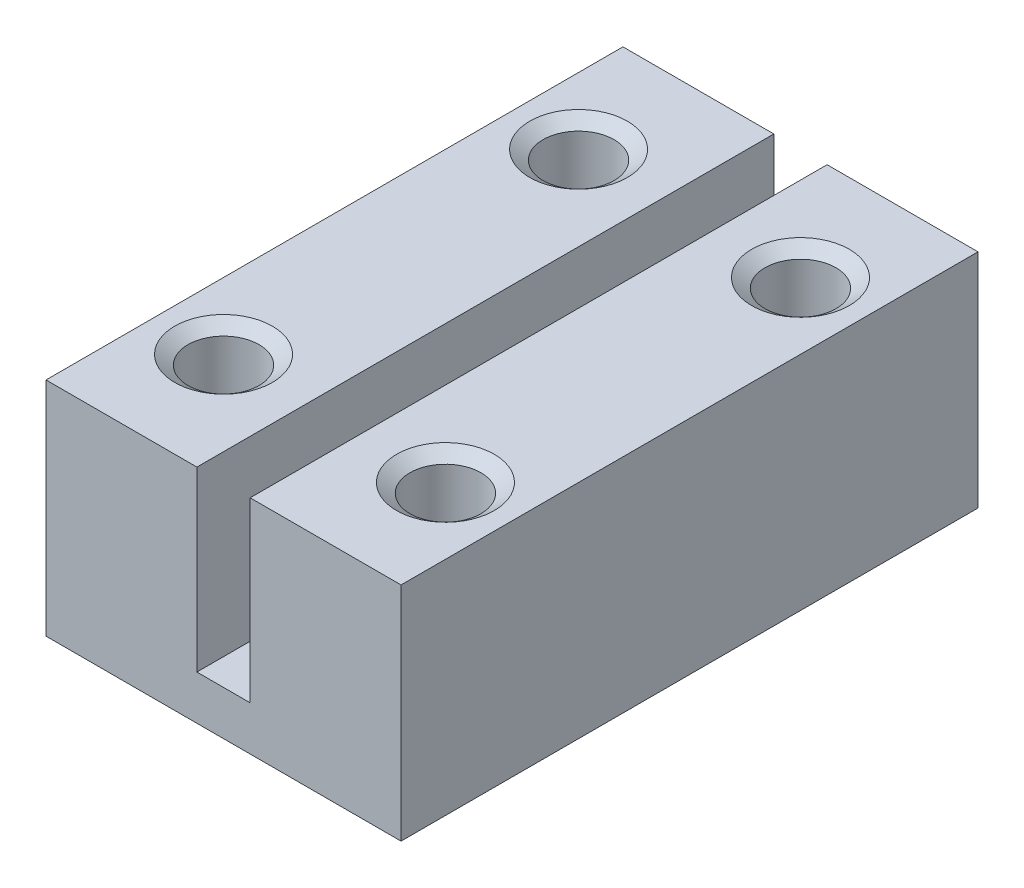
ISO-10303-21;
HEADER;
FILE_DESCRIPTION(('STEP AP214'),'2;1');
FILE_NAME('part.step','',(''),(''),'','','');
FILE_SCHEMA(('AUTOMOTIVE_DESIGN { 1 0 10303 214 1 1 1 1 }'));
ENDSEC;
DATA;
#1=APPLICATION_CONTEXT('core data for automotive mechanical design processes');
#2=APPLICATION_PROTOCOL_DEFINITION('international standard','automotive_design',2000,#1);
#3=PRODUCT_CONTEXT('',#1,'mechanical');
#4=PRODUCT('Part','Part','',(#3));
#5=PRODUCT_RELATED_PRODUCT_CATEGORY('part','',(#4));
#6=PRODUCT_DEFINITION_FORMATION('','',#4);
#7=PRODUCT_DEFINITION_CONTEXT('part definition',#1,'design');
#8=PRODUCT_DEFINITION('design','',#6,#7);
#9=PRODUCT_DEFINITION_SHAPE('','',#8);
#10=(LENGTH_UNIT() NAMED_UNIT(*) SI_UNIT(.MILLI.,.METRE.));
#11=(NAMED_UNIT(*) PLANE_ANGLE_UNIT() SI_UNIT($,.RADIAN.));
#12=(NAMED_UNIT(*) SI_UNIT($,.STERADIAN.) SOLID_ANGLE_UNIT());
#13=UNCERTAINTY_MEASURE_WITH_UNIT(LENGTH_MEASURE(1.E-05),#10,'distance_accuracy_value','');
#14=(GEOMETRIC_REPRESENTATION_CONTEXT(3) GLOBAL_UNCERTAINTY_ASSIGNED_CONTEXT((#13)) GLOBAL_UNIT_ASSIGNED_CONTEXT((#10,
#11,#12)) REPRESENTATION_CONTEXT('',''));
#15=CARTESIAN_POINT('',(0.,0.,0.));
#16=DIRECTION('',(0.,0.,1.));
#17=DIRECTION('',(1.,0.,0.));
#18=AXIS2_PLACEMENT_3D('',#15,#16,#17);
#19=CARTESIAN_POINT('',(-4.,0.,13.));
#20=DIRECTION('',(0.,1.,0.));
#21=DIRECTION('',(-1.,0.,0.));
#22=AXIS2_PLACEMENT_3D('',#19,#20,#21);
#23=PLANE('',#22);
#24=CARTESIAN_POINT('',(2.5,0.,10.5));
#25=DIRECTION('',(0.,-1.,0.));
#26=DIRECTION('',(0.,0.,-1.));
#27=AXIS2_PLACEMENT_3D('',#24,#25,#26);
#28=CIRCLE('',#27,1.1);
#29=CARTESIAN_POINT('',(2.5,0.,9.4));
#30=VERTEX_POINT('',#29);
#31=EDGE_CURVE('E204',#30,#30,#28,.T.);
#32=ORIENTED_EDGE('',*,*,#31,.F.);
#33=EDGE_LOOP('',(#32));
#34=FACE_BOUND('',#33,.T.);
#35=CARTESIAN_POINT('',(2.5,0.,2.5));
#36=DIRECTION('',(0.,-1.,0.));
#37=DIRECTION('',(0.,0.,-1.));
#38=AXIS2_PLACEMENT_3D('',#35,#36,#37);
#39=CIRCLE('',#38,1.1);
#40=CARTESIAN_POINT('',(2.5,0.,1.4));
#41=VERTEX_POINT('',#40);
#42=EDGE_CURVE('E192',#41,#41,#39,.T.);
#43=ORIENTED_EDGE('',*,*,#42,.F.);
#44=EDGE_LOOP('',(#43));
#45=FACE_BOUND('',#44,.T.);
#46=CARTESIAN_POINT('',(-2.5,0.,2.5));
#47=DIRECTION('',(0.,-1.,0.));
#48=DIRECTION('',(0.,0.,-1.));
#49=AXIS2_PLACEMENT_3D('',#46,#47,#48);
#50=CIRCLE('',#49,1.1);
#51=CARTESIAN_POINT('',(-2.5,0.,1.4));
#52=VERTEX_POINT('',#51);
#53=EDGE_CURVE('E180',#52,#52,#50,.T.);
#54=ORIENTED_EDGE('',*,*,#53,.F.);
#55=EDGE_LOOP('',(#54));
#56=FACE_BOUND('',#55,.T.);
#57=DIRECTION('',(1.,0.,0.));
#58=VECTOR('',#57,1.);
#59=CARTESIAN_POINT('',(-4.,0.,0.));
#60=LINE('',#59,#58);
#61=CARTESIAN_POINT('',(-4.,0.,0.));
#62=VERTEX_POINT('',#61);
#63=CARTESIAN_POINT('',(4.,0.,0.));
#64=VERTEX_POINT('',#63);
#65=EDGE_CURVE('E130',#62,#64,#60,.T.);
#66=ORIENTED_EDGE('',*,*,#65,.T.);
#67=DIRECTION('',(0.,0.,-1.));
#68=VECTOR('',#67,1.);
#69=CARTESIAN_POINT('',(4.,0.,13.));
#70=LINE('',#69,#68);
#71=CARTESIAN_POINT('',(4.,0.,13.));
#72=VERTEX_POINT('',#71);
#73=EDGE_CURVE('E39',#72,#64,#70,.T.);
#74=ORIENTED_EDGE('',*,*,#73,.F.);
#75=DIRECTION('',(1.,0.,0.));
#76=VECTOR('',#75,1.);
#77=CARTESIAN_POINT('',(-4.,0.,13.));
#78=LINE('',#77,#76);
#79=CARTESIAN_POINT('',(-4.,0.,13.));
#80=VERTEX_POINT('',#79);
#81=EDGE_CURVE('E90',#80,#72,#78,.T.);
#82=ORIENTED_EDGE('',*,*,#81,.F.);
#83=DIRECTION('',(0.,0.,-1.));
#84=VECTOR('',#83,1.);
#85=CARTESIAN_POINT('',(-4.,0.,13.));
#86=LINE('',#85,#84);
#87=EDGE_CURVE('E11',#80,#62,#86,.T.);
#88=ORIENTED_EDGE('',*,*,#87,.T.);
#89=EDGE_LOOP('',(#66,#74,#82,#88));
#90=FACE_BOUND('',#89,.T.);
#91=CARTESIAN_POINT('',(-2.5,0.,10.5));
#92=DIRECTION('',(0.,-1.,0.));
#93=DIRECTION('',(0.,0.,-1.));
#94=AXIS2_PLACEMENT_3D('',#91,#92,#93);
#95=CIRCLE('',#94,1.1);
#96=CARTESIAN_POINT('',(-2.5,0.,9.4));
#97=VERTEX_POINT('',#96);
#98=EDGE_CURVE('E216',#97,#97,#95,.T.);
#99=ORIENTED_EDGE('',*,*,#98,.F.);
#100=EDGE_LOOP('',(#99));
#101=FACE_BOUND('',#100,.T.);
#102=ADVANCED_FACE('F30',(#34,#45,#56,#90,#101),#23,.F.);
#103=CARTESIAN_POINT('',(-4.,0.,13.));
#104=DIRECTION('',(1.,0.,0.));
#105=DIRECTION('',(0.,0.,-1.));
#106=AXIS2_PLACEMENT_3D('',#103,#104,#105);
#107=PLANE('',#106);
#108=DIRECTION('',(0.,-1.,0.));
#109=VECTOR('',#108,1.);
#110=CARTESIAN_POINT('',(-4.,0.,0.));
#111=LINE('',#110,#109);
#112=CARTESIAN_POINT('',(-4.,5.,0.));
#113=VERTEX_POINT('',#112);
#114=EDGE_CURVE('E127',#113,#62,#111,.T.);
#115=ORIENTED_EDGE('',*,*,#114,.T.);
#116=ORIENTED_EDGE('',*,*,#87,.F.);
#117=DIRECTION('',(0.,-1.,0.));
#118=VECTOR('',#117,1.);
#119=CARTESIAN_POINT('',(-4.,0.,13.));
#120=LINE('',#119,#118);
#121=CARTESIAN_POINT('',(-4.,5.,13.));
#122=VERTEX_POINT('',#121);
#123=EDGE_CURVE('E142',#122,#80,#120,.T.);
#124=ORIENTED_EDGE('',*,*,#123,.F.);
#125=DIRECTION('',(0.,0.,-1.));
#126=VECTOR('',#125,1.);
#127=CARTESIAN_POINT('',(-4.,5.,13.));
#128=LINE('',#127,#126);
#129=EDGE_CURVE('E123',#122,#113,#128,.T.);
#130=ORIENTED_EDGE('',*,*,#129,.T.);
#131=EDGE_LOOP('',(#115,#116,#124,#130));
#132=FACE_BOUND('',#131,.T.);
#133=ADVANCED_FACE('F32',(#132),#107,.F.);
#134=CARTESIAN_POINT('',(4.,0.,13.));
#135=DIRECTION('',(-1.,0.,0.));
#136=DIRECTION('',(0.,0.,1.));
#137=AXIS2_PLACEMENT_3D('',#134,#135,#136);
#138=PLANE('',#137);
#139=DIRECTION('',(0.,1.,0.));
#140=VECTOR('',#139,1.);
#141=CARTESIAN_POINT('',(4.,0.,0.));
#142=LINE('',#141,#140);
#143=CARTESIAN_POINT('',(4.,5.,0.));
#144=VERTEX_POINT('',#143);
#145=EDGE_CURVE('E133',#64,#144,#142,.T.);
#146=ORIENTED_EDGE('',*,*,#145,.T.);
#147=DIRECTION('',(0.,0.,-1.));
#148=VECTOR('',#147,1.);
#149=CARTESIAN_POINT('',(4.,5.,13.));
#150=LINE('',#149,#148);
#151=CARTESIAN_POINT('',(4.,5.,13.));
#152=VERTEX_POINT('',#151);
#153=EDGE_CURVE('E149',#152,#144,#150,.T.);
#154=ORIENTED_EDGE('',*,*,#153,.F.);
#155=DIRECTION('',(0.,1.,0.));
#156=VECTOR('',#155,1.);
#157=CARTESIAN_POINT('',(4.,0.,13.));
#158=LINE('',#157,#156);
#159=EDGE_CURVE('E157',#72,#152,#158,.T.);
#160=ORIENTED_EDGE('',*,*,#159,.F.);
#161=ORIENTED_EDGE('',*,*,#73,.T.);
#162=EDGE_LOOP('',(#146,#154,#160,#161));
#163=FACE_BOUND('',#162,.T.);
#164=ADVANCED_FACE('F155',(#163),#138,.F.);
#165=CARTESIAN_POINT('',(0.6,5.,13.));
#166=DIRECTION('',(0.,-1.,0.));
#167=DIRECTION('',(0.,0.,-1.));
#168=AXIS2_PLACEMENT_3D('',#165,#166,#167);
#169=PLANE('',#168);
#170=CARTESIAN_POINT('',(2.5,5.,10.5));
#171=DIRECTION('',(0.,-1.,0.));
#172=DIRECTION('',(0.,0.,-1.));
#173=AXIS2_PLACEMENT_3D('',#170,#171,#172);
#174=CIRCLE('',#173,1.1);
#175=CARTESIAN_POINT('',(2.5,5.,9.4));
#176=VERTEX_POINT('',#175);
#177=EDGE_CURVE('E207',#176,#176,#174,.T.);
#178=ORIENTED_EDGE('',*,*,#177,.T.);
#179=EDGE_LOOP('',(#178));
#180=FACE_BOUND('',#179,.T.);
#181=CARTESIAN_POINT('',(2.5,5.,2.5));
#182=DIRECTION('',(0.,-1.,0.));
#183=DIRECTION('',(0.,0.,-1.));
#184=AXIS2_PLACEMENT_3D('',#181,#182,#183);
#185=CIRCLE('',#184,1.1);
#186=CARTESIAN_POINT('',(2.5,5.,1.4));
#187=VERTEX_POINT('',#186);
#188=EDGE_CURVE('E195',#187,#187,#185,.T.);
#189=ORIENTED_EDGE('',*,*,#188,.T.);
#190=EDGE_LOOP('',(#189));
#191=FACE_BOUND('',#190,.T.);
#192=DIRECTION('',(-1.,0.,0.));
#193=VECTOR('',#192,1.);
#194=CARTESIAN_POINT('',(0.6,5.,0.));
#195=LINE('',#194,#193);
#196=CARTESIAN_POINT('',(0.6,5.,0.));
#197=VERTEX_POINT('',#196);
#198=EDGE_CURVE('E135',#144,#197,#195,.T.);
#199=ORIENTED_EDGE('',*,*,#198,.T.);
#200=DIRECTION('',(0.,0.,-1.));
#201=VECTOR('',#200,1.);
#202=CARTESIAN_POINT('',(0.6,5.,13.));
#203=LINE('',#202,#201);
#204=CARTESIAN_POINT('',(0.6,5.,13.));
#205=VERTEX_POINT('',#204);
#206=EDGE_CURVE('E146',#205,#197,#203,.T.);
#207=ORIENTED_EDGE('',*,*,#206,.F.);
#208=DIRECTION('',(-1.,0.,0.));
#209=VECTOR('',#208,1.);
#210=CARTESIAN_POINT('',(0.6,5.,13.));
#211=LINE('',#210,#209);
#212=EDGE_CURVE('E169',#152,#205,#211,.T.);
#213=ORIENTED_EDGE('',*,*,#212,.F.);
#214=ORIENTED_EDGE('',*,*,#153,.T.);
#215=EDGE_LOOP('',(#199,#207,#213,#214));
#216=FACE_BOUND('',#215,.T.);
#217=ADVANCED_FACE('F165',(#180,#191,#216),#169,.F.);
#218=CARTESIAN_POINT('',(0.6,0.999999999999999,13.));
#219=DIRECTION('',(1.,0.,0.));
#220=DIRECTION('',(0.,1.,0.));
#221=AXIS2_PLACEMENT_3D('',#218,#219,#220);
#222=PLANE('',#221);
#223=DIRECTION('',(0.,-1.,0.));
#224=VECTOR('',#223,1.);
#225=CARTESIAN_POINT('',(0.6,0.999999999999999,0.));
#226=LINE('',#225,#224);
#227=CARTESIAN_POINT('',(0.6,0.999999999999999,0.));
#228=VERTEX_POINT('',#227);
#229=EDGE_CURVE('E137',#197,#228,#226,.T.);
#230=ORIENTED_EDGE('',*,*,#229,.T.);
#231=DIRECTION('',(0.,0.,-1.));
#232=VECTOR('',#231,1.);
#233=CARTESIAN_POINT('',(0.6,0.999999999999999,13.));
#234=LINE('',#233,#232);
#235=CARTESIAN_POINT('',(0.6,0.999999999999999,13.));
#236=VERTEX_POINT('',#235);
#237=EDGE_CURVE('E118',#236,#228,#234,.T.);
#238=ORIENTED_EDGE('',*,*,#237,.F.);
#239=DIRECTION('',(0.,-1.,0.));
#240=VECTOR('',#239,1.);
#241=CARTESIAN_POINT('',(0.6,0.999999999999999,13.));
#242=LINE('',#241,#240);
#243=EDGE_CURVE('E109',#205,#236,#242,.T.);
#244=ORIENTED_EDGE('',*,*,#243,.F.);
#245=ORIENTED_EDGE('',*,*,#206,.T.);
#246=EDGE_LOOP('',(#230,#238,#244,#245));
#247=FACE_BOUND('',#246,.T.);
#248=ADVANCED_FACE('F168',(#247),#222,.F.);
#249=CARTESIAN_POINT('',(-0.6,0.999999999999999,13.));
#250=DIRECTION('',(0.,-1.,0.));
#251=DIRECTION('',(0.,0.,-1.));
#252=AXIS2_PLACEMENT_3D('',#249,#250,#251);
#253=PLANE('',#252);
#254=DIRECTION('',(-1.,0.,0.));
#255=VECTOR('',#254,1.);
#256=CARTESIAN_POINT('',(-0.6,0.999999999999999,0.));
#257=LINE('',#256,#255);
#258=CARTESIAN_POINT('',(-0.6,0.999999999999999,0.));
#259=VERTEX_POINT('',#258);
#260=EDGE_CURVE('E117',#228,#259,#257,.T.);
#261=ORIENTED_EDGE('',*,*,#260,.T.);
#262=DIRECTION('',(0.,0.,-1.));
#263=VECTOR('',#262,1.);
#264=CARTESIAN_POINT('',(-0.6,0.999999999999999,13.));
#265=LINE('',#264,#263);
#266=CARTESIAN_POINT('',(-0.6,0.999999999999999,13.));
#267=VERTEX_POINT('',#266);
#268=EDGE_CURVE('E114',#267,#259,#265,.T.);
#269=ORIENTED_EDGE('',*,*,#268,.F.);
#270=DIRECTION('',(-1.,0.,0.));
#271=VECTOR('',#270,1.);
#272=CARTESIAN_POINT('',(-0.6,0.999999999999999,13.));
#273=LINE('',#272,#271);
#274=EDGE_CURVE('E103',#236,#267,#273,.T.);
#275=ORIENTED_EDGE('',*,*,#274,.F.);
#276=ORIENTED_EDGE('',*,*,#237,.T.);
#277=EDGE_LOOP('',(#261,#269,#275,#276));
#278=FACE_BOUND('',#277,.T.);
#279=ADVANCED_FACE('F115',(#278),#253,.F.);
#280=CARTESIAN_POINT('',(-0.6,5.,13.));
#281=DIRECTION('',(-1.,0.,0.));
#282=DIRECTION('',(0.,-1.,0.));
#283=AXIS2_PLACEMENT_3D('',#280,#281,#282);
#284=PLANE('',#283);
#285=DIRECTION('',(0.,1.,0.));
#286=VECTOR('',#285,1.);
#287=CARTESIAN_POINT('',(-0.6,5.,0.));
#288=LINE('',#287,#286);
#289=CARTESIAN_POINT('',(-0.6,5.,0.));
#290=VERTEX_POINT('',#289);
#291=EDGE_CURVE('E76',#259,#290,#288,.T.);
#292=ORIENTED_EDGE('',*,*,#291,.T.);
#293=DIRECTION('',(0.,0.,-1.));
#294=VECTOR('',#293,1.);
#295=CARTESIAN_POINT('',(-0.6,5.,13.));
#296=LINE('',#295,#294);
#297=CARTESIAN_POINT('',(-0.6,5.,13.));
#298=VERTEX_POINT('',#297);
#299=EDGE_CURVE('E119',#298,#290,#296,.T.);
#300=ORIENTED_EDGE('',*,*,#299,.F.);
#301=DIRECTION('',(0.,1.,0.));
#302=VECTOR('',#301,1.);
#303=CARTESIAN_POINT('',(-0.6,5.,13.));
#304=LINE('',#303,#302);
#305=EDGE_CURVE('E107',#267,#298,#304,.T.);
#306=ORIENTED_EDGE('',*,*,#305,.F.);
#307=ORIENTED_EDGE('',*,*,#268,.T.);
#308=EDGE_LOOP('',(#292,#300,#306,#307));
#309=FACE_BOUND('',#308,.T.);
#310=ADVANCED_FACE('F121',(#309),#284,.F.);
#311=CARTESIAN_POINT('',(-4.,5.,13.));
#312=DIRECTION('',(0.,-1.,0.));
#313=DIRECTION('',(0.,0.,-1.));
#314=AXIS2_PLACEMENT_3D('',#311,#312,#313);
#315=PLANE('',#314);
#316=CARTESIAN_POINT('',(-2.5,5.,10.5));
#317=DIRECTION('',(0.,-1.,0.));
#318=DIRECTION('',(0.,0.,-1.));
#319=AXIS2_PLACEMENT_3D('',#316,#317,#318);
#320=CIRCLE('',#319,1.1);
#321=CARTESIAN_POINT('',(-2.5,5.,9.4));
#322=VERTEX_POINT('',#321);
#323=EDGE_CURVE('E219',#322,#322,#320,.T.);
#324=ORIENTED_EDGE('',*,*,#323,.T.);
#325=EDGE_LOOP('',(#324));
#326=FACE_BOUND('',#325,.T.);
#327=CARTESIAN_POINT('',(-2.5,5.,2.5));
#328=DIRECTION('',(0.,-1.,0.));
#329=DIRECTION('',(0.,0.,-1.));
#330=AXIS2_PLACEMENT_3D('',#327,#328,#329);
#331=CIRCLE('',#330,1.1);
#332=CARTESIAN_POINT('',(-2.5,5.,1.4));
#333=VERTEX_POINT('',#332);
#334=EDGE_CURVE('E183',#333,#333,#331,.T.);
#335=ORIENTED_EDGE('',*,*,#334,.T.);
#336=EDGE_LOOP('',(#335));
#337=FACE_BOUND('',#336,.T.);
#338=DIRECTION('',(-1.,0.,0.));
#339=VECTOR('',#338,1.);
#340=CARTESIAN_POINT('',(-4.,5.,0.));
#341=LINE('',#340,#339);
#342=EDGE_CURVE('E82',#290,#113,#341,.T.);
#343=ORIENTED_EDGE('',*,*,#342,.T.);
#344=ORIENTED_EDGE('',*,*,#129,.F.);
#345=DIRECTION('',(-1.,0.,0.));
#346=VECTOR('',#345,1.);
#347=CARTESIAN_POINT('',(-4.,5.,13.));
#348=LINE('',#347,#346);
#349=EDGE_CURVE('E47',#298,#122,#348,.T.);
#350=ORIENTED_EDGE('',*,*,#349,.F.);
#351=ORIENTED_EDGE('',*,*,#299,.T.);
#352=EDGE_LOOP('',(#343,#344,#350,#351));
#353=FACE_BOUND('',#352,.T.);
#354=ADVANCED_FACE('F223',(#326,#337,#353),#315,.F.);
#355=CARTESIAN_POINT('',(-4.,5.,13.));
#356=DIRECTION('',(0.,0.,-1.));
#357=DIRECTION('',(-1.,0.,0.));
#358=AXIS2_PLACEMENT_3D('',#355,#356,#357);
#359=PLANE('',#358);
#360=ORIENTED_EDGE('',*,*,#123,.T.);
#361=ORIENTED_EDGE('',*,*,#81,.T.);
#362=ORIENTED_EDGE('',*,*,#159,.T.);
#363=ORIENTED_EDGE('',*,*,#212,.T.);
#364=ORIENTED_EDGE('',*,*,#243,.T.);
#365=ORIENTED_EDGE('',*,*,#274,.T.);
#366=ORIENTED_EDGE('',*,*,#305,.T.);
#367=ORIENTED_EDGE('',*,*,#349,.T.);
#368=EDGE_LOOP('',(#360,#361,#362,#363,#364,#365,#366,#367));
#369=FACE_BOUND('',#368,.T.);
#370=ADVANCED_FACE('F105',(#369),#359,.F.);
#371=CARTESIAN_POINT('',(-4.,5.,0.));
#372=DIRECTION('',(0.,0.,-1.));
#373=DIRECTION('',(-1.,0.,0.));
#374=AXIS2_PLACEMENT_3D('',#371,#372,#373);
#375=PLANE('',#374);
#376=ORIENTED_EDGE('',*,*,#114,.F.);
#377=ORIENTED_EDGE('',*,*,#342,.F.);
#378=ORIENTED_EDGE('',*,*,#291,.F.);
#379=ORIENTED_EDGE('',*,*,#260,.F.);
#380=ORIENTED_EDGE('',*,*,#229,.F.);
#381=ORIENTED_EDGE('',*,*,#198,.F.);
#382=ORIENTED_EDGE('',*,*,#145,.F.);
#383=ORIENTED_EDGE('',*,*,#65,.F.);
#384=EDGE_LOOP('',(#376,#377,#378,#379,#380,#381,#382,#383));
#385=FACE_BOUND('',#384,.T.);
#386=ADVANCED_FACE('F161',(#385),#375,.T.);
#387=CARTESIAN_POINT('',(-2.5,4.78993773853709,2.5));
#388=DIRECTION('',(0.,1.,0.));
#389=DIRECTION('',(0.,0.,1.));
#390=AXIS2_PLACEMENT_3D('',#387,#388,#389);
#391=CONICAL_SURFACE('',#390,0.799999999999999,0.95993108859688);
#392=ORIENTED_EDGE('',*,*,#334,.F.);
#393=EDGE_LOOP('',(#392));
#394=FACE_BOUND('',#393,.T.);
#395=CARTESIAN_POINT('',(-2.5,4.78993773853709,2.5));
#396=DIRECTION('',(0.,-1.,0.));
#397=DIRECTION('',(0.,0.,-1.));
#398=AXIS2_PLACEMENT_3D('',#395,#396,#397);
#399=CIRCLE('',#398,0.799999999999999);
#400=CARTESIAN_POINT('',(-2.5,4.78993773853709,1.7));
#401=VERTEX_POINT('',#400);
#402=EDGE_CURVE('E131',#401,#401,#399,.T.);
#403=ORIENTED_EDGE('',*,*,#402,.T.);
#404=EDGE_LOOP('',(#403));
#405=FACE_BOUND('',#404,.T.);
#406=ADVANCED_FACE('F269',(#394,#405),#391,.F.);
#407=CARTESIAN_POINT('',(-2.5,0.,2.5));
#408=DIRECTION('',(0.,-1.,0.));
#409=DIRECTION('',(0.,0.,-1.));
#410=AXIS2_PLACEMENT_3D('',#407,#408,#409);
#411=CYLINDRICAL_SURFACE('',#410,0.799999999999999);
#412=ORIENTED_EDGE('',*,*,#402,.F.);
#413=EDGE_LOOP('',(#412));
#414=FACE_BOUND('',#413,.T.);
#415=CARTESIAN_POINT('',(-2.5,0.3,2.5));
#416=DIRECTION('',(0.,-1.,0.));
#417=DIRECTION('',(0.,0.,-1.));
#418=AXIS2_PLACEMENT_3D('',#415,#416,#417);
#419=CIRCLE('',#418,0.8);
#420=CARTESIAN_POINT('',(-2.5,0.3,1.7));
#421=VERTEX_POINT('',#420);
#422=EDGE_CURVE('E177',#421,#421,#419,.T.);
#423=ORIENTED_EDGE('',*,*,#422,.T.);
#424=EDGE_LOOP('',(#423));
#425=FACE_BOUND('',#424,.T.);
#426=ADVANCED_FACE('F274',(#414,#425),#411,.F.);
#427=CARTESIAN_POINT('',(-2.5,0.,2.5));
#428=DIRECTION('',(0.,-1.,0.));
#429=DIRECTION('',(0.,0.,-1.));
#430=AXIS2_PLACEMENT_3D('',#427,#428,#429);
#431=CONICAL_SURFACE('',#430,1.1,0.785398163397445);
#432=ORIENTED_EDGE('',*,*,#422,.F.);
#433=EDGE_LOOP('',(#432));
#434=FACE_BOUND('',#433,.T.);
#435=ORIENTED_EDGE('',*,*,#53,.T.);
#436=EDGE_LOOP('',(#435));
#437=FACE_BOUND('',#436,.T.);
#438=ADVANCED_FACE('F278',(#434,#437),#431,.F.);
#439=CARTESIAN_POINT('',(2.5,4.78993773853709,2.5));
#440=DIRECTION('',(0.,1.,0.));
#441=DIRECTION('',(0.,0.,1.));
#442=AXIS2_PLACEMENT_3D('',#439,#440,#441);
#443=CONICAL_SURFACE('',#442,0.799999999999999,0.95993108859688);
#444=ORIENTED_EDGE('',*,*,#188,.F.);
#445=EDGE_LOOP('',(#444));
#446=FACE_BOUND('',#445,.T.);
#447=CARTESIAN_POINT('',(2.5,4.78993773853709,2.5));
#448=DIRECTION('',(0.,-1.,0.));
#449=DIRECTION('',(0.,0.,-1.));
#450=AXIS2_PLACEMENT_3D('',#447,#448,#449);
#451=CIRCLE('',#450,0.799999999999999);
#452=CARTESIAN_POINT('',(2.5,4.78993773853709,1.7));
#453=VERTEX_POINT('',#452);
#454=EDGE_CURVE('E186',#453,#453,#451,.T.);
#455=ORIENTED_EDGE('',*,*,#454,.T.);
#456=EDGE_LOOP('',(#455));
#457=FACE_BOUND('',#456,.T.);
#458=ADVANCED_FACE('F282',(#446,#457),#443,.F.);
#459=CARTESIAN_POINT('',(2.5,0.,2.5));
#460=DIRECTION('',(0.,-1.,0.));
#461=DIRECTION('',(0.,0.,-1.));
#462=AXIS2_PLACEMENT_3D('',#459,#460,#461);
#463=CYLINDRICAL_SURFACE('',#462,0.799999999999999);
#464=ORIENTED_EDGE('',*,*,#454,.F.);
#465=EDGE_LOOP('',(#464));
#466=FACE_BOUND('',#465,.T.);
#467=CARTESIAN_POINT('',(2.5,0.300000000000001,2.5));
#468=DIRECTION('',(0.,-1.,0.));
#469=DIRECTION('',(0.,0.,-1.));
#470=AXIS2_PLACEMENT_3D('',#467,#468,#469);
#471=CIRCLE('',#470,0.8);
#472=CARTESIAN_POINT('',(2.5,0.300000000000001,1.7));
#473=VERTEX_POINT('',#472);
#474=EDGE_CURVE('E189',#473,#473,#471,.T.);
#475=ORIENTED_EDGE('',*,*,#474,.T.);
#476=EDGE_LOOP('',(#475));
#477=FACE_BOUND('',#476,.T.);
#478=ADVANCED_FACE('F286',(#466,#477),#463,.F.);
#479=CARTESIAN_POINT('',(2.5,0.,2.5));
#480=DIRECTION('',(0.,-1.,0.));
#481=DIRECTION('',(0.,0.,-1.));
#482=AXIS2_PLACEMENT_3D('',#479,#480,#481);
#483=CONICAL_SURFACE('',#482,1.1,0.785398163397445);
#484=ORIENTED_EDGE('',*,*,#474,.F.);
#485=EDGE_LOOP('',(#484));
#486=FACE_BOUND('',#485,.T.);
#487=ORIENTED_EDGE('',*,*,#42,.T.);
#488=EDGE_LOOP('',(#487));
#489=FACE_BOUND('',#488,.T.);
#490=ADVANCED_FACE('F290',(#486,#489),#483,.F.);
#491=CARTESIAN_POINT('',(2.5,4.78993773853709,10.5));
#492=DIRECTION('',(0.,1.,0.));
#493=DIRECTION('',(0.,0.,1.));
#494=AXIS2_PLACEMENT_3D('',#491,#492,#493);
#495=CONICAL_SURFACE('',#494,0.799999999999999,0.95993108859688);
#496=ORIENTED_EDGE('',*,*,#177,.F.);
#497=EDGE_LOOP('',(#496));
#498=FACE_BOUND('',#497,.T.);
#499=CARTESIAN_POINT('',(2.5,4.78993773853709,10.5));
#500=DIRECTION('',(0.,-1.,0.));
#501=DIRECTION('',(0.,0.,-1.));
#502=AXIS2_PLACEMENT_3D('',#499,#500,#501);
#503=CIRCLE('',#502,0.799999999999999);
#504=CARTESIAN_POINT('',(2.5,4.78993773853709,9.7));
#505=VERTEX_POINT('',#504);
#506=EDGE_CURVE('E198',#505,#505,#503,.T.);
#507=ORIENTED_EDGE('',*,*,#506,.T.);
#508=EDGE_LOOP('',(#507));
#509=FACE_BOUND('',#508,.T.);
#510=ADVANCED_FACE('F294',(#498,#509),#495,.F.);
#511=CARTESIAN_POINT('',(2.5,0.,10.5));
#512=DIRECTION('',(0.,-1.,0.));
#513=DIRECTION('',(0.,0.,-1.));
#514=AXIS2_PLACEMENT_3D('',#511,#512,#513);
#515=CYLINDRICAL_SURFACE('',#514,0.799999999999999);
#516=ORIENTED_EDGE('',*,*,#506,.F.);
#517=EDGE_LOOP('',(#516));
#518=FACE_BOUND('',#517,.T.);
#519=CARTESIAN_POINT('',(2.5,0.300000000000001,10.5));
#520=DIRECTION('',(0.,-1.,0.));
#521=DIRECTION('',(0.,0.,-1.));
#522=AXIS2_PLACEMENT_3D('',#519,#520,#521);
#523=CIRCLE('',#522,0.8);
#524=CARTESIAN_POINT('',(2.5,0.300000000000001,9.7));
#525=VERTEX_POINT('',#524);
#526=EDGE_CURVE('E201',#525,#525,#523,.T.);
#527=ORIENTED_EDGE('',*,*,#526,.T.);
#528=EDGE_LOOP('',(#527));
#529=FACE_BOUND('',#528,.T.);
#530=ADVANCED_FACE('F298',(#518,#529),#515,.F.);
#531=CARTESIAN_POINT('',(2.5,0.,10.5));
#532=DIRECTION('',(0.,-1.,0.));
#533=DIRECTION('',(0.,0.,-1.));
#534=AXIS2_PLACEMENT_3D('',#531,#532,#533);
#535=CONICAL_SURFACE('',#534,1.1,0.785398163397445);
#536=ORIENTED_EDGE('',*,*,#526,.F.);
#537=EDGE_LOOP('',(#536));
#538=FACE_BOUND('',#537,.T.);
#539=ORIENTED_EDGE('',*,*,#31,.T.);
#540=EDGE_LOOP('',(#539));
#541=FACE_BOUND('',#540,.T.);
#542=ADVANCED_FACE('F230',(#538,#541),#535,.F.);
#543=CARTESIAN_POINT('',(-2.5,4.78993773853709,10.5));
#544=DIRECTION('',(0.,1.,0.));
#545=DIRECTION('',(0.,0.,1.));
#546=AXIS2_PLACEMENT_3D('',#543,#544,#545);
#547=CONICAL_SURFACE('',#546,0.799999999999999,0.95993108859688);
#548=ORIENTED_EDGE('',*,*,#323,.F.);
#549=EDGE_LOOP('',(#548));
#550=FACE_BOUND('',#549,.T.);
#551=CARTESIAN_POINT('',(-2.5,4.78993773853709,10.5));
#552=DIRECTION('',(0.,-1.,0.));
#553=DIRECTION('',(0.,0.,-1.));
#554=AXIS2_PLACEMENT_3D('',#551,#552,#553);
#555=CIRCLE('',#554,0.799999999999999);
#556=CARTESIAN_POINT('',(-2.5,4.78993773853709,9.7));
#557=VERTEX_POINT('',#556);
#558=EDGE_CURVE('E210',#557,#557,#555,.T.);
#559=ORIENTED_EDGE('',*,*,#558,.T.);
#560=EDGE_LOOP('',(#559));
#561=FACE_BOUND('',#560,.T.);
#562=ADVANCED_FACE('F226',(#550,#561),#547,.F.);
#563=CARTESIAN_POINT('',(-2.5,0.,10.5));
#564=DIRECTION('',(0.,-1.,0.));
#565=DIRECTION('',(0.,0.,-1.));
#566=AXIS2_PLACEMENT_3D('',#563,#564,#565);
#567=CYLINDRICAL_SURFACE('',#566,0.799999999999999);
#568=ORIENTED_EDGE('',*,*,#558,.F.);
#569=EDGE_LOOP('',(#568));
#570=FACE_BOUND('',#569,.T.);
#571=CARTESIAN_POINT('',(-2.5,0.3,10.5));
#572=DIRECTION('',(0.,-1.,0.));
#573=DIRECTION('',(0.,0.,-1.));
#574=AXIS2_PLACEMENT_3D('',#571,#572,#573);
#575=CIRCLE('',#574,0.8);
#576=CARTESIAN_POINT('',(-2.5,0.3,9.7));
#577=VERTEX_POINT('',#576);
#578=EDGE_CURVE('E213',#577,#577,#575,.T.);
#579=ORIENTED_EDGE('',*,*,#578,.T.);
#580=EDGE_LOOP('',(#579));
#581=FACE_BOUND('',#580,.T.);
#582=ADVANCED_FACE('F229',(#570,#581),#567,.F.);
#583=CARTESIAN_POINT('',(-2.5,0.,10.5));
#584=DIRECTION('',(0.,-1.,0.));
#585=DIRECTION('',(0.,0.,-1.));
#586=AXIS2_PLACEMENT_3D('',#583,#584,#585);
#587=CONICAL_SURFACE('',#586,1.1,0.785398163397445);
#588=ORIENTED_EDGE('',*,*,#578,.F.);
#589=EDGE_LOOP('',(#588));
#590=FACE_BOUND('',#589,.T.);
#591=ORIENTED_EDGE('',*,*,#98,.T.);
#592=EDGE_LOOP('',(#591));
#593=FACE_BOUND('',#592,.T.);
#594=ADVANCED_FACE('F236',(#590,#593),#587,.F.);
#595=CLOSED_SHELL('',(#102,#133,#164,#217,#248,#279,#310,#354,#370,#386,#406,#426,#438,#458,
#478,#490,#510,#530,#542,#562,#582,#594));
#596=MANIFOLD_SOLID_BREP('B2',#595);
#597=ADVANCED_BREP_SHAPE_REPRESENTATION('',(#18,#596),#14);
#598=SHAPE_DEFINITION_REPRESENTATION(#9,#597);
ENDSEC;
END-ISO-10303-21;
